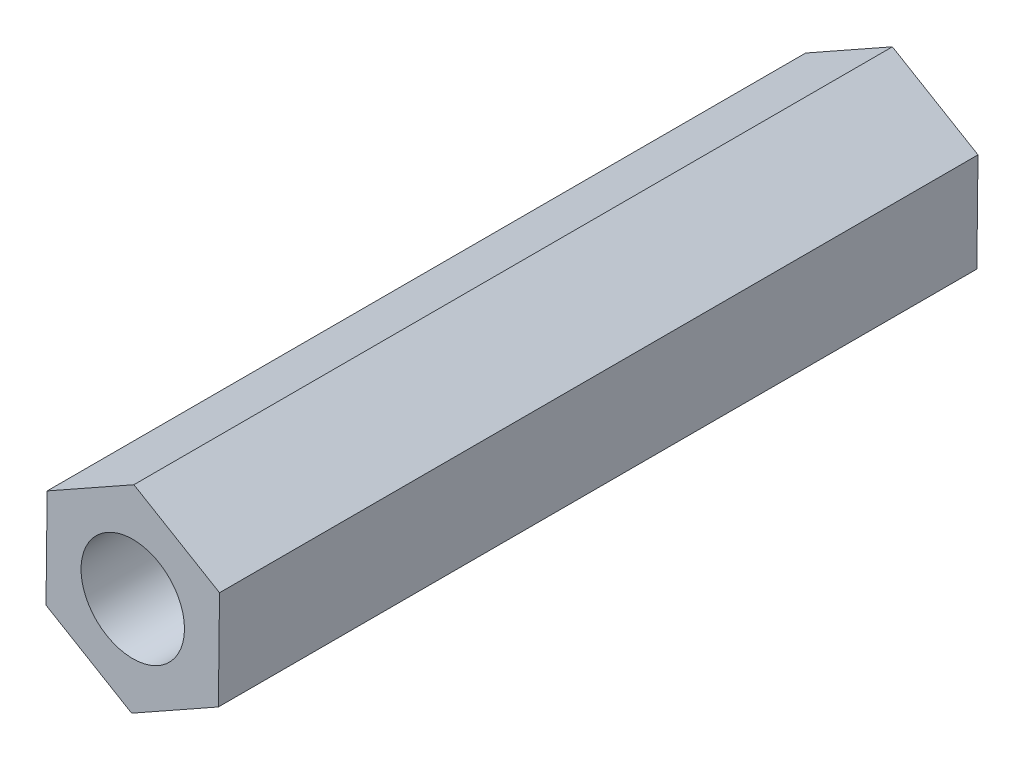
ISO-10303-21;
HEADER;
FILE_DESCRIPTION(('STEP AP214'),'2;1');
FILE_NAME('part.step','',(''),(''),'','','');
FILE_SCHEMA(('AUTOMOTIVE_DESIGN { 1 0 10303 214 1 1 1 1 }'));
ENDSEC;
DATA;
#1=APPLICATION_CONTEXT('core data for automotive mechanical design processes');
#2=APPLICATION_PROTOCOL_DEFINITION('international standard','automotive_design',2000,#1);
#3=PRODUCT_CONTEXT('',#1,'mechanical');
#4=PRODUCT('Part','Part','',(#3));
#5=PRODUCT_RELATED_PRODUCT_CATEGORY('part','',(#4));
#6=PRODUCT_DEFINITION_FORMATION('','',#4);
#7=PRODUCT_DEFINITION_CONTEXT('part definition',#1,'design');
#8=PRODUCT_DEFINITION('design','',#6,#7);
#9=PRODUCT_DEFINITION_SHAPE('','',#8);
#10=(LENGTH_UNIT() NAMED_UNIT(*) SI_UNIT(.MILLI.,.METRE.));
#11=(NAMED_UNIT(*) PLANE_ANGLE_UNIT() SI_UNIT($,.RADIAN.));
#12=(NAMED_UNIT(*) SI_UNIT($,.STERADIAN.) SOLID_ANGLE_UNIT());
#13=UNCERTAINTY_MEASURE_WITH_UNIT(LENGTH_MEASURE(1.E-05),#10,'distance_accuracy_value','');
#14=(GEOMETRIC_REPRESENTATION_CONTEXT(3) GLOBAL_UNCERTAINTY_ASSIGNED_CONTEXT((#13)) GLOBAL_UNIT_ASSIGNED_CONTEXT((#10,
#11,#12)) REPRESENTATION_CONTEXT('',''));
#15=CARTESIAN_POINT('',(0.,0.,0.));
#16=DIRECTION('',(0.,0.,1.));
#17=DIRECTION('',(1.,0.,0.));
#18=AXIS2_PLACEMENT_3D('',#15,#16,#17);
#19=CARTESIAN_POINT('',(0.,0.,22.));
#20=DIRECTION('',(0.,0.,1.));
#21=DIRECTION('',(1.,0.,0.));
#22=AXIS2_PLACEMENT_3D('',#19,#20,#21);
#23=PLANE('',#22);
#24=DIRECTION('',(-0.871741235138785,-0.489966548816046,0.));
#25=VECTOR('',#24,1.);
#26=CARTESIAN_POINT('',(0.0333337198875714,2.8865588849791,22.));
#27=LINE('',#26,#25);
#28=CARTESIAN_POINT('',(0.0333337198875714,2.8865588849791,22.));
#29=VERTEX_POINT('',#28);
#30=CARTESIAN_POINT('',(-2.4831664639678,1.47214729071482,22.));
#31=VERTEX_POINT('',#30);
#32=EDGE_CURVE('E136',#29,#31,#27,.T.);
#33=ORIENTED_EDGE('',*,*,#32,.T.);
#34=DIRECTION('',(-0.0115471392901081,-0.999933329564634,0.));
#35=VECTOR('',#34,1.);
#36=CARTESIAN_POINT('',(-2.4831664639678,1.47214729071482,22.));
#37=LINE('',#36,#35);
#38=CARTESIAN_POINT('',(-2.51650018385537,-1.41441159426428,22.));
#39=VERTEX_POINT('',#38);
#40=EDGE_CURVE('E94',#31,#39,#37,.T.);
#41=ORIENTED_EDGE('',*,*,#40,.T.);
#42=DIRECTION('',(0.860194095848676,-0.509966780748588,0.));
#43=VECTOR('',#42,1.);
#44=CARTESIAN_POINT('',(-2.51650018385537,-1.41441159426428,22.));
#45=LINE('',#44,#43);
#46=CARTESIAN_POINT('',(-0.0333337198875706,-2.8865588849791,22.));
#47=VERTEX_POINT('',#46);
#48=EDGE_CURVE('E107',#39,#47,#45,.T.);
#49=ORIENTED_EDGE('',*,*,#48,.T.);
#50=DIRECTION('',(0.871741235138785,0.489966548816046,0.));
#51=VECTOR('',#50,1.);
#52=CARTESIAN_POINT('',(-0.0333337198875706,-2.8865588849791,22.));
#53=LINE('',#52,#51);
#54=CARTESIAN_POINT('',(2.4831664639678,-1.47214729071482,22.));
#55=VERTEX_POINT('',#54);
#56=EDGE_CURVE('E101',#47,#55,#53,.T.);
#57=ORIENTED_EDGE('',*,*,#56,.T.);
#58=DIRECTION('',(0.0115471392901082,0.999933329564634,0.));
#59=VECTOR('',#58,1.);
#60=CARTESIAN_POINT('',(2.4831664639678,-1.47214729071482,22.));
#61=LINE('',#60,#59);
#62=CARTESIAN_POINT('',(2.51650018385537,1.41441159426428,22.));
#63=VERTEX_POINT('',#62);
#64=EDGE_CURVE('E105',#55,#63,#61,.T.);
#65=ORIENTED_EDGE('',*,*,#64,.T.);
#66=DIRECTION('',(-0.860194095848676,0.509966780748588,0.));
#67=VECTOR('',#66,1.);
#68=CARTESIAN_POINT('',(2.51650018385537,1.41441159426428,22.));
#69=LINE('',#68,#67);
#70=EDGE_CURVE('E57',#63,#29,#69,.T.);
#71=ORIENTED_EDGE('',*,*,#70,.T.);
#72=EDGE_LOOP('',(#33,#41,#49,#57,#65,#71));
#73=FACE_BOUND('',#72,.T.);
#74=CARTESIAN_POINT('',(0.,0.,22.));
#75=DIRECTION('',(0.,0.,1.));
#76=DIRECTION('',(1.,0.,0.));
#77=AXIS2_PLACEMENT_3D('',#74,#75,#76);
#78=CIRCLE('',#77,1.5);
#79=CARTESIAN_POINT('',(1.5,0.,22.));
#80=VERTEX_POINT('',#79);
#81=EDGE_CURVE('E129',#80,#80,#78,.T.);
#82=ORIENTED_EDGE('',*,*,#81,.F.);
#83=EDGE_LOOP('',(#82));
#84=FACE_BOUND('',#83,.T.);
#85=ADVANCED_FACE('F40',(#73,#84),#23,.T.);
#86=CARTESIAN_POINT('',(0.,0.,0.));
#87=DIRECTION('',(0.,0.,1.));
#88=DIRECTION('',(1.,0.,0.));
#89=AXIS2_PLACEMENT_3D('',#86,#87,#88);
#90=PLANE('',#89);
#91=DIRECTION('',(-0.871741235138785,-0.489966548816046,0.));
#92=VECTOR('',#91,1.);
#93=CARTESIAN_POINT('',(0.0333337198875714,2.8865588849791,0.));
#94=LINE('',#93,#92);
#95=CARTESIAN_POINT('',(0.0333337198875714,2.8865588849791,0.));
#96=VERTEX_POINT('',#95);
#97=CARTESIAN_POINT('',(-2.4831664639678,1.47214729071482,0.));
#98=VERTEX_POINT('',#97);
#99=EDGE_CURVE('E125',#96,#98,#94,.T.);
#100=ORIENTED_EDGE('',*,*,#99,.F.);
#101=DIRECTION('',(-0.860194095848676,0.509966780748588,0.));
#102=VECTOR('',#101,1.);
#103=CARTESIAN_POINT('',(2.51650018385537,1.41441159426428,0.));
#104=LINE('',#103,#102);
#105=CARTESIAN_POINT('',(2.51650018385537,1.41441159426428,0.));
#106=VERTEX_POINT('',#105);
#107=EDGE_CURVE('E86',#106,#96,#104,.T.);
#108=ORIENTED_EDGE('',*,*,#107,.F.);
#109=DIRECTION('',(0.0115471392901082,0.999933329564634,0.));
#110=VECTOR('',#109,1.);
#111=CARTESIAN_POINT('',(2.4831664639678,-1.47214729071482,0.));
#112=LINE('',#111,#110);
#113=CARTESIAN_POINT('',(2.4831664639678,-1.47214729071482,0.));
#114=VERTEX_POINT('',#113);
#115=EDGE_CURVE('E80',#114,#106,#112,.T.);
#116=ORIENTED_EDGE('',*,*,#115,.F.);
#117=DIRECTION('',(0.871741235138785,0.489966548816046,0.));
#118=VECTOR('',#117,1.);
#119=CARTESIAN_POINT('',(-0.0333337198875706,-2.8865588849791,0.));
#120=LINE('',#119,#118);
#121=CARTESIAN_POINT('',(-0.0333337198875706,-2.8865588849791,0.));
#122=VERTEX_POINT('',#121);
#123=EDGE_CURVE('E115',#122,#114,#120,.T.);
#124=ORIENTED_EDGE('',*,*,#123,.F.);
#125=DIRECTION('',(0.860194095848676,-0.509966780748588,0.));
#126=VECTOR('',#125,1.);
#127=CARTESIAN_POINT('',(-2.51650018385537,-1.41441159426428,0.));
#128=LINE('',#127,#126);
#129=CARTESIAN_POINT('',(-2.51650018385537,-1.41441159426428,0.));
#130=VERTEX_POINT('',#129);
#131=EDGE_CURVE('E131',#130,#122,#128,.T.);
#132=ORIENTED_EDGE('',*,*,#131,.F.);
#133=DIRECTION('',(-0.0115471392901081,-0.999933329564634,0.));
#134=VECTOR('',#133,1.);
#135=CARTESIAN_POINT('',(-2.4831664639678,1.47214729071482,0.));
#136=LINE('',#135,#134);
#137=EDGE_CURVE('E128',#98,#130,#136,.T.);
#138=ORIENTED_EDGE('',*,*,#137,.F.);
#139=EDGE_LOOP('',(#100,#108,#116,#124,#132,#138));
#140=FACE_BOUND('',#139,.T.);
#141=CARTESIAN_POINT('',(0.,0.,0.));
#142=DIRECTION('',(0.,0.,1.));
#143=DIRECTION('',(1.,0.,0.));
#144=AXIS2_PLACEMENT_3D('',#141,#142,#143);
#145=CIRCLE('',#144,1.5);
#146=CARTESIAN_POINT('',(1.5,0.,0.));
#147=VERTEX_POINT('',#146);
#148=EDGE_CURVE('E265',#147,#147,#145,.T.);
#149=ORIENTED_EDGE('',*,*,#148,.T.);
#150=EDGE_LOOP('',(#149));
#151=FACE_BOUND('',#150,.T.);
#152=ADVANCED_FACE('F145',(#140,#151),#90,.F.);
#153=CARTESIAN_POINT('',(0.0333337198875714,2.8865588849791,22.));
#154=DIRECTION('',(0.489966548816046,-0.871741235138785,0.));
#155=DIRECTION('',(0.871741235138785,0.489966548816046,0.));
#156=AXIS2_PLACEMENT_3D('',#153,#154,#155);
#157=PLANE('',#156);
#158=ORIENTED_EDGE('',*,*,#99,.T.);
#159=DIRECTION('',(0.,0.,-1.));
#160=VECTOR('',#159,1.);
#161=CARTESIAN_POINT('',(-2.4831664639678,1.47214729071482,22.));
#162=LINE('',#161,#160);
#163=EDGE_CURVE('E11',#31,#98,#162,.T.);
#164=ORIENTED_EDGE('',*,*,#163,.F.);
#165=ORIENTED_EDGE('',*,*,#32,.F.);
#166=DIRECTION('',(0.,0.,-1.));
#167=VECTOR('',#166,1.);
#168=CARTESIAN_POINT('',(0.0333337198875714,2.8865588849791,22.));
#169=LINE('',#168,#167);
#170=EDGE_CURVE('E121',#29,#96,#169,.T.);
#171=ORIENTED_EDGE('',*,*,#170,.T.);
#172=EDGE_LOOP('',(#158,#164,#165,#171));
#173=FACE_BOUND('',#172,.T.);
#174=ADVANCED_FACE('F42',(#173),#157,.F.);
#175=CARTESIAN_POINT('',(-2.4831664639678,1.47214729071482,22.));
#176=DIRECTION('',(0.999933329564634,-0.0115471392901081,0.));
#177=DIRECTION('',(0.0115471392901081,0.999933329564634,0.));
#178=AXIS2_PLACEMENT_3D('',#175,#176,#177);
#179=PLANE('',#178);
#180=ORIENTED_EDGE('',*,*,#137,.T.);
#181=DIRECTION('',(0.,0.,-1.));
#182=VECTOR('',#181,1.);
#183=CARTESIAN_POINT('',(-2.51650018385537,-1.41441159426428,22.));
#184=LINE('',#183,#182);
#185=EDGE_CURVE('E49',#39,#130,#184,.T.);
#186=ORIENTED_EDGE('',*,*,#185,.F.);
#187=ORIENTED_EDGE('',*,*,#40,.F.);
#188=ORIENTED_EDGE('',*,*,#163,.T.);
#189=EDGE_LOOP('',(#180,#186,#187,#188));
#190=FACE_BOUND('',#189,.T.);
#191=ADVANCED_FACE('F170',(#190),#179,.F.);
#192=CARTESIAN_POINT('',(-2.51650018385537,-1.41441159426428,22.));
#193=DIRECTION('',(0.509966780748588,0.860194095848676,0.));
#194=DIRECTION('',(-0.860194095848676,0.509966780748588,0.));
#195=AXIS2_PLACEMENT_3D('',#192,#193,#194);
#196=PLANE('',#195);
#197=ORIENTED_EDGE('',*,*,#131,.T.);
#198=DIRECTION('',(0.,0.,-1.));
#199=VECTOR('',#198,1.);
#200=CARTESIAN_POINT('',(-0.0333337198875706,-2.8865588849791,22.));
#201=LINE('',#200,#199);
#202=EDGE_CURVE('E116',#47,#122,#201,.T.);
#203=ORIENTED_EDGE('',*,*,#202,.F.);
#204=ORIENTED_EDGE('',*,*,#48,.F.);
#205=ORIENTED_EDGE('',*,*,#185,.T.);
#206=EDGE_LOOP('',(#197,#203,#204,#205));
#207=FACE_BOUND('',#206,.T.);
#208=ADVANCED_FACE('F142',(#207),#196,.F.);
#209=CARTESIAN_POINT('',(-0.0333337198875706,-2.8865588849791,22.));
#210=DIRECTION('',(-0.489966548816046,0.871741235138785,0.));
#211=DIRECTION('',(-0.871741235138785,-0.489966548816046,0.));
#212=AXIS2_PLACEMENT_3D('',#209,#210,#211);
#213=PLANE('',#212);
#214=ORIENTED_EDGE('',*,*,#123,.T.);
#215=DIRECTION('',(0.,0.,-1.));
#216=VECTOR('',#215,1.);
#217=CARTESIAN_POINT('',(2.4831664639678,-1.47214729071482,22.));
#218=LINE('',#217,#216);
#219=EDGE_CURVE('E112',#55,#114,#218,.T.);
#220=ORIENTED_EDGE('',*,*,#219,.F.);
#221=ORIENTED_EDGE('',*,*,#56,.F.);
#222=ORIENTED_EDGE('',*,*,#202,.T.);
#223=EDGE_LOOP('',(#214,#220,#221,#222));
#224=FACE_BOUND('',#223,.T.);
#225=ADVANCED_FACE('F113',(#224),#213,.F.);
#226=CARTESIAN_POINT('',(2.4831664639678,-1.47214729071482,22.));
#227=DIRECTION('',(-0.999933329564634,0.0115471392901082,0.));
#228=DIRECTION('',(-0.0115471392901082,-0.999933329564634,0.));
#229=AXIS2_PLACEMENT_3D('',#226,#227,#228);
#230=PLANE('',#229);
#231=ORIENTED_EDGE('',*,*,#115,.T.);
#232=DIRECTION('',(0.,0.,-1.));
#233=VECTOR('',#232,1.);
#234=CARTESIAN_POINT('',(2.51650018385537,1.41441159426428,22.));
#235=LINE('',#234,#233);
#236=EDGE_CURVE('E117',#63,#106,#235,.T.);
#237=ORIENTED_EDGE('',*,*,#236,.F.);
#238=ORIENTED_EDGE('',*,*,#64,.F.);
#239=ORIENTED_EDGE('',*,*,#219,.T.);
#240=EDGE_LOOP('',(#231,#237,#238,#239));
#241=FACE_BOUND('',#240,.T.);
#242=ADVANCED_FACE('F119',(#241),#230,.F.);
#243=CARTESIAN_POINT('',(2.51650018385537,1.41441159426428,22.));
#244=DIRECTION('',(-0.509966780748588,-0.860194095848676,0.));
#245=DIRECTION('',(0.860194095848676,-0.509966780748588,0.));
#246=AXIS2_PLACEMENT_3D('',#243,#244,#245);
#247=PLANE('',#246);
#248=ORIENTED_EDGE('',*,*,#107,.T.);
#249=ORIENTED_EDGE('',*,*,#170,.F.);
#250=ORIENTED_EDGE('',*,*,#70,.F.);
#251=ORIENTED_EDGE('',*,*,#236,.T.);
#252=EDGE_LOOP('',(#248,#249,#250,#251));
#253=FACE_BOUND('',#252,.T.);
#254=ADVANCED_FACE('F150',(#253),#247,.F.);
#255=CARTESIAN_POINT('',(0.,0.,22.));
#256=DIRECTION('',(0.,0.,-1.));
#257=DIRECTION('',(-1.,0.,0.));
#258=AXIS2_PLACEMENT_3D('',#255,#256,#257);
#259=CYLINDRICAL_SURFACE('',#258,1.5);
#260=ORIENTED_EDGE('',*,*,#81,.T.);
#261=EDGE_LOOP('',(#260));
#262=FACE_BOUND('',#261,.T.);
#263=ORIENTED_EDGE('',*,*,#148,.F.);
#264=EDGE_LOOP('',(#263));
#265=FACE_BOUND('',#264,.T.);
#266=ADVANCED_FACE('F152',(#262,#265),#259,.F.);
#267=CLOSED_SHELL('',(#85,#152,#174,#191,#208,#225,#242,#254,#266));
#268=MANIFOLD_SOLID_BREP('B2',#267);
#269=ADVANCED_BREP_SHAPE_REPRESENTATION('',(#18,#268),#14);
#270=SHAPE_DEFINITION_REPRESENTATION(#9,#269);
ENDSEC;
END-ISO-10303-21;
